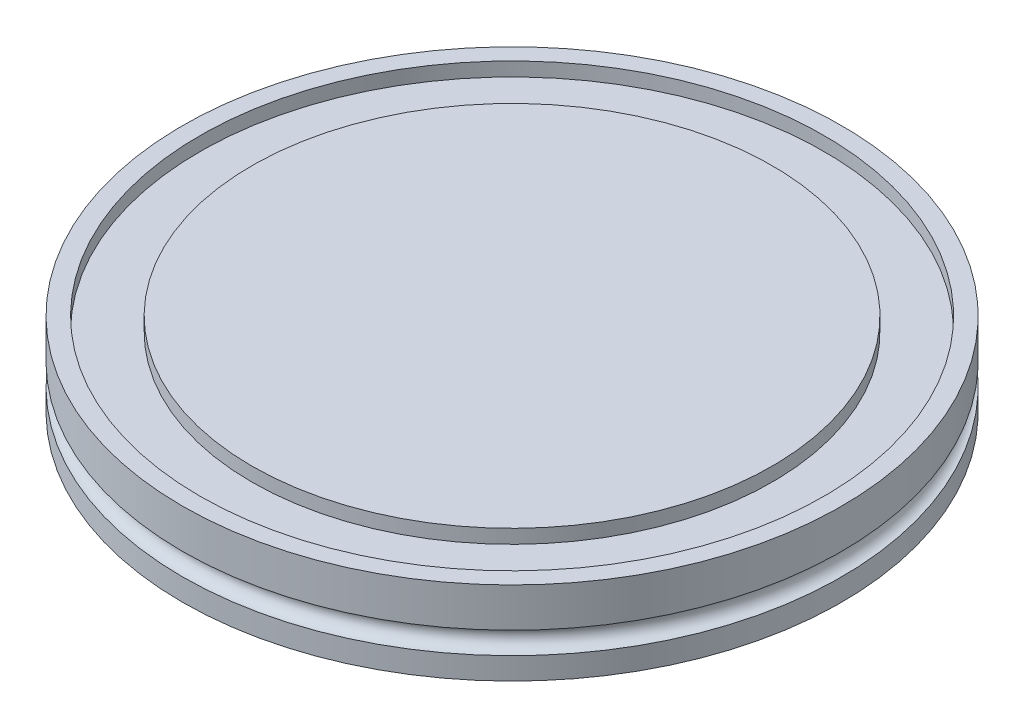
ISO-10303-21;
HEADER;
FILE_DESCRIPTION(('STEP AP214'),'2;1');
FILE_NAME('part.step','',(''),(''),'','','');
FILE_SCHEMA(('AUTOMOTIVE_DESIGN { 1 0 10303 214 1 1 1 1 }'));
ENDSEC;
DATA;
#1=APPLICATION_CONTEXT('core data for automotive mechanical design processes');
#2=APPLICATION_PROTOCOL_DEFINITION('international standard','automotive_design',2000,#1);
#3=PRODUCT_CONTEXT('',#1,'mechanical');
#4=PRODUCT('Part','Part','',(#3));
#5=PRODUCT_RELATED_PRODUCT_CATEGORY('part','',(#4));
#6=PRODUCT_DEFINITION_FORMATION('','',#4);
#7=PRODUCT_DEFINITION_CONTEXT('part definition',#1,'design');
#8=PRODUCT_DEFINITION('design','',#6,#7);
#9=PRODUCT_DEFINITION_SHAPE('','',#8);
#10=(LENGTH_UNIT() NAMED_UNIT(*) SI_UNIT(.MILLI.,.METRE.));
#11=(NAMED_UNIT(*) PLANE_ANGLE_UNIT() SI_UNIT($,.RADIAN.));
#12=(NAMED_UNIT(*) SI_UNIT($,.STERADIAN.) SOLID_ANGLE_UNIT());
#13=UNCERTAINTY_MEASURE_WITH_UNIT(LENGTH_MEASURE(1.E-05),#10,'distance_accuracy_value','');
#14=(GEOMETRIC_REPRESENTATION_CONTEXT(3) GLOBAL_UNCERTAINTY_ASSIGNED_CONTEXT((#13)) GLOBAL_UNIT_ASSIGNED_CONTEXT((#10,
#11,#12)) REPRESENTATION_CONTEXT('',''));
#15=CARTESIAN_POINT('',(0.,0.,0.));
#16=DIRECTION('',(0.,0.,1.));
#17=DIRECTION('',(1.,0.,0.));
#18=AXIS2_PLACEMENT_3D('',#15,#16,#17);
#19=CARTESIAN_POINT('',(0.,12.,0.));
#20=DIRECTION('',(0.,1.,0.));
#21=DIRECTION('',(0.,0.,1.));
#22=AXIS2_PLACEMENT_3D('',#19,#20,#21);
#23=PLANE('',#22);
#24=CARTESIAN_POINT('',(0.,12.,0.));
#25=DIRECTION('',(0.,1.,0.));
#26=DIRECTION('',(0.,0.,1.));
#27=AXIS2_PLACEMENT_3D('',#24,#25,#26);
#28=CIRCLE('',#27,37.5);
#29=CARTESIAN_POINT('',(0.,12.,37.5));
#30=VERTEX_POINT('',#29);
#31=EDGE_CURVE('E10',#30,#30,#28,.T.);
#32=ORIENTED_EDGE('',*,*,#31,.T.);
#33=EDGE_LOOP('',(#32));
#34=FACE_BOUND('',#33,.T.);
#35=ADVANCED_FACE('F33',(#34),#23,.T.);
#36=CARTESIAN_POINT('',(0.,0.,0.));
#37=DIRECTION('',(0.,1.,0.));
#38=DIRECTION('',(0.,0.,1.));
#39=AXIS2_PLACEMENT_3D('',#36,#37,#38);
#40=CYLINDRICAL_SURFACE('',#39,37.5);
#41=CARTESIAN_POINT('',(0.,9.99999999999999,0.));
#42=DIRECTION('',(0.,1.,0.));
#43=DIRECTION('',(0.,0.,1.));
#44=AXIS2_PLACEMENT_3D('',#41,#42,#43);
#45=CIRCLE('',#44,37.5);
#46=CARTESIAN_POINT('',(0.,9.99999999999999,37.5));
#47=VERTEX_POINT('',#46);
#48=EDGE_CURVE('E39',#47,#47,#45,.T.);
#49=ORIENTED_EDGE('',*,*,#48,.T.);
#50=EDGE_LOOP('',(#49));
#51=FACE_BOUND('',#50,.T.);
#52=ORIENTED_EDGE('',*,*,#31,.F.);
#53=EDGE_LOOP('',(#52));
#54=FACE_BOUND('',#53,.T.);
#55=ADVANCED_FACE('F89',(#51,#54),#40,.T.);
#56=CARTESIAN_POINT('',(-45.,9.99999999999999,0.));
#57=DIRECTION('',(0.,1.,0.));
#58=DIRECTION('',(0.,0.,1.));
#59=AXIS2_PLACEMENT_3D('',#56,#57,#58);
#60=PLANE('',#59);
#61=CARTESIAN_POINT('',(0.,9.99999999999999,0.));
#62=DIRECTION('',(0.,1.,0.));
#63=DIRECTION('',(0.,0.,1.));
#64=AXIS2_PLACEMENT_3D('',#61,#62,#63);
#65=CIRCLE('',#64,45.);
#66=CARTESIAN_POINT('',(0.,9.99999999999999,45.));
#67=VERTEX_POINT('',#66);
#68=EDGE_CURVE('E43',#67,#67,#65,.T.);
#69=ORIENTED_EDGE('',*,*,#68,.T.);
#70=EDGE_LOOP('',(#69));
#71=FACE_BOUND('',#70,.T.);
#72=ORIENTED_EDGE('',*,*,#48,.F.);
#73=EDGE_LOOP('',(#72));
#74=FACE_BOUND('',#73,.T.);
#75=ADVANCED_FACE('F93',(#71,#74),#60,.T.);
#76=CARTESIAN_POINT('',(0.,0.,0.));
#77=DIRECTION('',(0.,1.,0.));
#78=DIRECTION('',(0.,0.,1.));
#79=AXIS2_PLACEMENT_3D('',#76,#77,#78);
#80=CYLINDRICAL_SURFACE('',#79,45.);
#81=CARTESIAN_POINT('',(0.,12.,0.));
#82=DIRECTION('',(0.,1.,0.));
#83=DIRECTION('',(0.,0.,1.));
#84=AXIS2_PLACEMENT_3D('',#81,#82,#83);
#85=CIRCLE('',#84,45.);
#86=CARTESIAN_POINT('',(0.,12.,45.));
#87=VERTEX_POINT('',#86);
#88=EDGE_CURVE('E47',#87,#87,#85,.T.);
#89=ORIENTED_EDGE('',*,*,#88,.T.);
#90=EDGE_LOOP('',(#89));
#91=FACE_BOUND('',#90,.T.);
#92=ORIENTED_EDGE('',*,*,#68,.F.);
#93=EDGE_LOOP('',(#92));
#94=FACE_BOUND('',#93,.T.);
#95=ADVANCED_FACE('F97',(#91,#94),#80,.F.);
#96=CARTESIAN_POINT('',(-45.,12.,0.));
#97=DIRECTION('',(0.,1.,0.));
#98=DIRECTION('',(0.,0.,1.));
#99=AXIS2_PLACEMENT_3D('',#96,#97,#98);
#100=PLANE('',#99);
#101=CARTESIAN_POINT('',(0.,12.,0.));
#102=DIRECTION('',(0.,1.,0.));
#103=DIRECTION('',(0.,0.,1.));
#104=AXIS2_PLACEMENT_3D('',#101,#102,#103);
#105=CIRCLE('',#104,47.5);
#106=CARTESIAN_POINT('',(0.,12.,47.5));
#107=VERTEX_POINT('',#106);
#108=EDGE_CURVE('E52',#107,#107,#105,.T.);
#109=ORIENTED_EDGE('',*,*,#108,.T.);
#110=EDGE_LOOP('',(#109));
#111=FACE_BOUND('',#110,.T.);
#112=ORIENTED_EDGE('',*,*,#88,.F.);
#113=EDGE_LOOP('',(#112));
#114=FACE_BOUND('',#113,.T.);
#115=ADVANCED_FACE('F104',(#111,#114),#100,.T.);
#116=CARTESIAN_POINT('',(0.,0.,0.));
#117=DIRECTION('',(0.,1.,0.));
#118=DIRECTION('',(0.,0.,1.));
#119=AXIS2_PLACEMENT_3D('',#116,#117,#118);
#120=CYLINDRICAL_SURFACE('',#119,47.5);
#121=CARTESIAN_POINT('',(0.,6.34999999999999,0.));
#122=DIRECTION('',(0.,1.,0.));
#123=DIRECTION('',(0.,0.,1.));
#124=AXIS2_PLACEMENT_3D('',#121,#122,#123);
#125=CIRCLE('',#124,47.5);
#126=CARTESIAN_POINT('',(0.,6.34999999999999,47.5));
#127=VERTEX_POINT('',#126);
#128=EDGE_CURVE('E55',#127,#127,#125,.T.);
#129=ORIENTED_EDGE('',*,*,#128,.T.);
#130=EDGE_LOOP('',(#129));
#131=FACE_BOUND('',#130,.T.);
#132=ORIENTED_EDGE('',*,*,#108,.F.);
#133=EDGE_LOOP('',(#132));
#134=FACE_BOUND('',#133,.T.);
#135=ADVANCED_FACE('F108',(#131,#134),#120,.T.);
#136=CARTESIAN_POINT('',(0.,4.76249999999999,0.));
#137=DIRECTION('',(0.,1.,0.));
#138=DIRECTION('',(0.,0.,1.));
#139=AXIS2_PLACEMENT_3D('',#136,#137,#138);
#140=TOROIDAL_SURFACE('',#139,47.5,1.5875);
#141=CARTESIAN_POINT('',(0.,3.17499999999999,0.));
#142=DIRECTION('',(0.,1.,0.));
#143=DIRECTION('',(0.,0.,1.));
#144=AXIS2_PLACEMENT_3D('',#141,#142,#143);
#145=CIRCLE('',#144,47.5);
#146=CARTESIAN_POINT('',(0.,3.17499999999999,47.5));
#147=VERTEX_POINT('',#146);
#148=EDGE_CURVE('E58',#147,#147,#145,.T.);
#149=ORIENTED_EDGE('',*,*,#148,.T.);
#150=EDGE_LOOP('',(#149));
#151=FACE_BOUND('',#150,.T.);
#152=ORIENTED_EDGE('',*,*,#128,.F.);
#153=EDGE_LOOP('',(#152));
#154=FACE_BOUND('',#153,.T.);
#155=ADVANCED_FACE('F112',(#151,#154),#140,.F.);
#156=CARTESIAN_POINT('',(0.,0.,0.));
#157=DIRECTION('',(0.,1.,0.));
#158=DIRECTION('',(0.,0.,1.));
#159=AXIS2_PLACEMENT_3D('',#156,#157,#158);
#160=CYLINDRICAL_SURFACE('',#159,47.5);
#161=CARTESIAN_POINT('',(0.,0.,0.));
#162=DIRECTION('',(0.,1.,0.));
#163=DIRECTION('',(0.,0.,1.));
#164=AXIS2_PLACEMENT_3D('',#161,#162,#163);
#165=CIRCLE('',#164,47.5);
#166=CARTESIAN_POINT('',(0.,0.,47.5));
#167=VERTEX_POINT('',#166);
#168=EDGE_CURVE('E61',#167,#167,#165,.T.);
#169=ORIENTED_EDGE('',*,*,#168,.T.);
#170=EDGE_LOOP('',(#169));
#171=FACE_BOUND('',#170,.T.);
#172=ORIENTED_EDGE('',*,*,#148,.F.);
#173=EDGE_LOOP('',(#172));
#174=FACE_BOUND('',#173,.T.);
#175=ADVANCED_FACE('F116',(#171,#174),#160,.T.);
#176=CARTESIAN_POINT('',(-35.,0.,0.));
#177=DIRECTION('',(0.,-1.,0.));
#178=DIRECTION('',(0.,0.,-1.));
#179=AXIS2_PLACEMENT_3D('',#176,#177,#178);
#180=PLANE('',#179);
#181=CARTESIAN_POINT('',(0.,0.,0.));
#182=DIRECTION('',(0.,1.,0.));
#183=DIRECTION('',(0.,0.,1.));
#184=AXIS2_PLACEMENT_3D('',#181,#182,#183);
#185=CIRCLE('',#184,35.);
#186=CARTESIAN_POINT('',(0.,0.,35.));
#187=VERTEX_POINT('',#186);
#188=EDGE_CURVE('E64',#187,#187,#185,.T.);
#189=ORIENTED_EDGE('',*,*,#188,.T.);
#190=EDGE_LOOP('',(#189));
#191=FACE_BOUND('',#190,.T.);
#192=ORIENTED_EDGE('',*,*,#168,.F.);
#193=EDGE_LOOP('',(#192));
#194=FACE_BOUND('',#193,.T.);
#195=ADVANCED_FACE('F120',(#191,#194),#180,.T.);
#196=CARTESIAN_POINT('',(0.,0.,0.));
#197=DIRECTION('',(0.,1.,0.));
#198=DIRECTION('',(0.,0.,1.));
#199=AXIS2_PLACEMENT_3D('',#196,#197,#198);
#200=CYLINDRICAL_SURFACE('',#199,35.);
#201=CARTESIAN_POINT('',(0.,3.8,0.));
#202=DIRECTION('',(0.,1.,0.));
#203=DIRECTION('',(0.,0.,1.));
#204=AXIS2_PLACEMENT_3D('',#201,#202,#203);
#205=CIRCLE('',#204,35.);
#206=CARTESIAN_POINT('',(0.,3.8,35.));
#207=VERTEX_POINT('',#206);
#208=EDGE_CURVE('E67',#207,#207,#205,.T.);
#209=ORIENTED_EDGE('',*,*,#208,.T.);
#210=EDGE_LOOP('',(#209));
#211=FACE_BOUND('',#210,.T.);
#212=ORIENTED_EDGE('',*,*,#188,.F.);
#213=EDGE_LOOP('',(#212));
#214=FACE_BOUND('',#213,.T.);
#215=ADVANCED_FACE('F124',(#211,#214),#200,.F.);
#216=CARTESIAN_POINT('',(-35.,3.8,0.));
#217=DIRECTION('',(0.,-1.,0.));
#218=DIRECTION('',(0.,0.,-1.));
#219=AXIS2_PLACEMENT_3D('',#216,#217,#218);
#220=PLANE('',#219);
#221=CARTESIAN_POINT('',(0.,3.79999999999999,0.));
#222=DIRECTION('',(0.,1.,0.));
#223=DIRECTION('',(0.,0.,1.));
#224=AXIS2_PLACEMENT_3D('',#221,#222,#223);
#225=CIRCLE('',#224,28.65);
#226=CARTESIAN_POINT('',(0.,3.79999999999999,28.65));
#227=VERTEX_POINT('',#226);
#228=EDGE_CURVE('E70',#227,#227,#225,.T.);
#229=ORIENTED_EDGE('',*,*,#228,.T.);
#230=EDGE_LOOP('',(#229));
#231=FACE_BOUND('',#230,.T.);
#232=ORIENTED_EDGE('',*,*,#208,.F.);
#233=EDGE_LOOP('',(#232));
#234=FACE_BOUND('',#233,.T.);
#235=ADVANCED_FACE('F86',(#231,#234),#220,.T.);
#236=CARTESIAN_POINT('',(0.,0.,0.));
#237=DIRECTION('',(0.,1.,0.));
#238=DIRECTION('',(0.,0.,1.));
#239=AXIS2_PLACEMENT_3D('',#236,#237,#238);
#240=CYLINDRICAL_SURFACE('',#239,28.65);
#241=CARTESIAN_POINT('',(0.,0.,0.));
#242=DIRECTION('',(0.,1.,0.));
#243=DIRECTION('',(0.,0.,1.));
#244=AXIS2_PLACEMENT_3D('',#241,#242,#243);
#245=CIRCLE('',#244,28.65);
#246=CARTESIAN_POINT('',(0.,0.,28.65));
#247=VERTEX_POINT('',#246);
#248=EDGE_CURVE('E73',#247,#247,#245,.T.);
#249=ORIENTED_EDGE('',*,*,#248,.T.);
#250=EDGE_LOOP('',(#249));
#251=FACE_BOUND('',#250,.T.);
#252=ORIENTED_EDGE('',*,*,#228,.F.);
#253=EDGE_LOOP('',(#252));
#254=FACE_BOUND('',#253,.T.);
#255=ADVANCED_FACE('F77',(#251,#254),#240,.T.);
#256=CARTESIAN_POINT('',(0.,0.,0.));
#257=DIRECTION('',(0.,-1.,0.));
#258=DIRECTION('',(0.,0.,-1.));
#259=AXIS2_PLACEMENT_3D('',#256,#257,#258);
#260=PLANE('',#259);
#261=ORIENTED_EDGE('',*,*,#248,.F.);
#262=EDGE_LOOP('',(#261));
#263=FACE_BOUND('',#262,.T.);
#264=ADVANCED_FACE('F80',(#263),#260,.T.);
#265=CLOSED_SHELL('',(#35,#55,#75,#95,#115,#135,#155,#175,#195,#215,#235,#255,#264));
#266=MANIFOLD_SOLID_BREP('B2',#265);
#267=ADVANCED_BREP_SHAPE_REPRESENTATION('',(#18,#266),#14);
#268=SHAPE_DEFINITION_REPRESENTATION(#9,#267);
ENDSEC;
END-ISO-10303-21;
